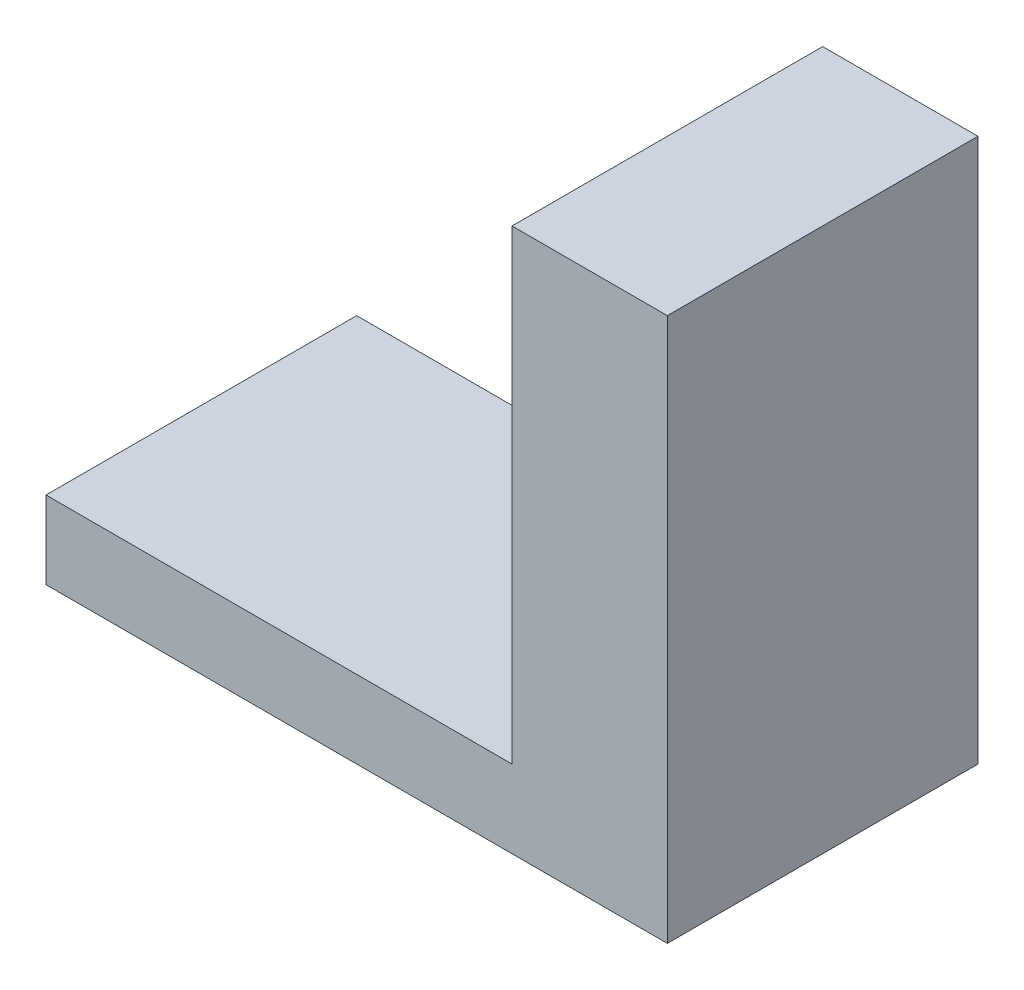
ISO-10303-21;
HEADER;
FILE_DESCRIPTION(('STEP AP214'),'2;1');
FILE_NAME('part.step','',(''),(''),'','','');
FILE_SCHEMA(('AUTOMOTIVE_DESIGN { 1 0 10303 214 1 1 1 1 }'));
ENDSEC;
DATA;
#1=APPLICATION_CONTEXT('core data for automotive mechanical design processes');
#2=APPLICATION_PROTOCOL_DEFINITION('international standard','automotive_design',2000,#1);
#3=PRODUCT_CONTEXT('',#1,'mechanical');
#4=PRODUCT('Part','Part','',(#3));
#5=PRODUCT_RELATED_PRODUCT_CATEGORY('part','',(#4));
#6=PRODUCT_DEFINITION_FORMATION('','',#4);
#7=PRODUCT_DEFINITION_CONTEXT('part definition',#1,'design');
#8=PRODUCT_DEFINITION('design','',#6,#7);
#9=PRODUCT_DEFINITION_SHAPE('','',#8);
#10=(LENGTH_UNIT() NAMED_UNIT(*) SI_UNIT(.MILLI.,.METRE.));
#11=(NAMED_UNIT(*) PLANE_ANGLE_UNIT() SI_UNIT($,.RADIAN.));
#12=(NAMED_UNIT(*) SI_UNIT($,.STERADIAN.) SOLID_ANGLE_UNIT());
#13=UNCERTAINTY_MEASURE_WITH_UNIT(LENGTH_MEASURE(1.E-05),#10,'distance_accuracy_value','');
#14=(GEOMETRIC_REPRESENTATION_CONTEXT(3) GLOBAL_UNCERTAINTY_ASSIGNED_CONTEXT((#13)) GLOBAL_UNIT_ASSIGNED_CONTEXT((#10,
#11,#12)) REPRESENTATION_CONTEXT('',''));
#15=CARTESIAN_POINT('',(0.,0.,0.));
#16=DIRECTION('',(0.,0.,1.));
#17=DIRECTION('',(1.,0.,0.));
#18=AXIS2_PLACEMENT_3D('',#15,#16,#17);
#19=CARTESIAN_POINT('',(-13.6877777777778,3.175,-6.17361111111111));
#20=DIRECTION('',(1.,0.,0.));
#21=DIRECTION('',(0.,0.,-1.));
#22=AXIS2_PLACEMENT_3D('',#19,#20,#21);
#23=PLANE('',#22);
#24=DIRECTION('',(0.,0.,1.));
#25=VECTOR('',#24,1.);
#26=CARTESIAN_POINT('',(-13.6877777777778,0.,-6.17361111111111));
#27=LINE('',#26,#25);
#28=CARTESIAN_POINT('',(-13.6877777777778,0.,-6.17361111111111));
#29=VERTEX_POINT('',#28);
#30=CARTESIAN_POINT('',(-13.6877777777778,0.,6.52638888888889));
#31=VERTEX_POINT('',#30);
#32=EDGE_CURVE('E89',#29,#31,#27,.T.);
#33=ORIENTED_EDGE('',*,*,#32,.T.);
#34=DIRECTION('',(0.,-1.,0.));
#35=VECTOR('',#34,1.);
#36=CARTESIAN_POINT('',(-13.6877777777778,3.175,6.52638888888889));
#37=LINE('',#36,#35);
#38=CARTESIAN_POINT('',(-13.6877777777778,3.175,6.52638888888889));
#39=VERTEX_POINT('',#38);
#40=EDGE_CURVE('E11',#39,#31,#37,.T.);
#41=ORIENTED_EDGE('',*,*,#40,.F.);
#42=DIRECTION('',(0.,0.,1.));
#43=VECTOR('',#42,1.);
#44=CARTESIAN_POINT('',(-13.6877777777778,3.175,-6.17361111111111));
#45=LINE('',#44,#43);
#46=CARTESIAN_POINT('',(-13.6877777777778,3.175,-6.17361111111111));
#47=VERTEX_POINT('',#46);
#48=EDGE_CURVE('E83',#47,#39,#45,.T.);
#49=ORIENTED_EDGE('',*,*,#48,.F.);
#50=DIRECTION('',(0.,-1.,0.));
#51=VECTOR('',#50,1.);
#52=CARTESIAN_POINT('',(-13.6877777777778,3.175,-6.17361111111111));
#53=LINE('',#52,#51);
#54=EDGE_CURVE('E75',#47,#29,#53,.T.);
#55=ORIENTED_EDGE('',*,*,#54,.T.);
#56=EDGE_LOOP('',(#33,#41,#49,#55));
#57=FACE_BOUND('',#56,.T.);
#58=ADVANCED_FACE('F33',(#57),#23,.F.);
#59=CARTESIAN_POINT('',(-13.6877777777778,3.175,6.52638888888889));
#60=DIRECTION('',(0.,0.,-1.));
#61=DIRECTION('',(-1.,0.,0.));
#62=AXIS2_PLACEMENT_3D('',#59,#60,#61);
#63=PLANE('',#62);
#64=DIRECTION('',(1.,0.,0.));
#65=VECTOR('',#64,1.);
#66=CARTESIAN_POINT('',(-13.6877777777778,0.,6.52638888888889));
#67=LINE('',#66,#65);
#68=CARTESIAN_POINT('',(11.7122222222222,0.,6.52638888888889));
#69=VERTEX_POINT('',#68);
#70=EDGE_CURVE('E92',#31,#69,#67,.T.);
#71=ORIENTED_EDGE('',*,*,#70,.T.);
#72=DIRECTION('',(0.,-1.,0.));
#73=VECTOR('',#72,1.);
#74=CARTESIAN_POINT('',(11.7122222222222,3.175,6.52638888888889));
#75=LINE('',#74,#73);
#76=CARTESIAN_POINT('',(11.7122222222222,22.225,6.52638888888889));
#77=VERTEX_POINT('',#76);
#78=EDGE_CURVE('E40',#77,#69,#75,.T.);
#79=ORIENTED_EDGE('',*,*,#78,.F.);
#80=DIRECTION('',(1.,0.,0.));
#81=VECTOR('',#80,1.);
#82=CARTESIAN_POINT('',(11.7122222222222,22.225,6.52638888888889));
#83=LINE('',#82,#81);
#84=CARTESIAN_POINT('',(5.36222222222222,22.225,6.52638888888889));
#85=VERTEX_POINT('',#84);
#86=EDGE_CURVE('E116',#85,#77,#83,.T.);
#87=ORIENTED_EDGE('',*,*,#86,.F.);
#88=DIRECTION('',(0.,-1.,0.));
#89=VECTOR('',#88,1.);
#90=CARTESIAN_POINT('',(5.36222222222222,22.225,6.52638888888889));
#91=LINE('',#90,#89);
#92=CARTESIAN_POINT('',(5.36222222222222,3.175,6.52638888888889));
#93=VERTEX_POINT('',#92);
#94=EDGE_CURVE('E97',#85,#93,#91,.T.);
#95=ORIENTED_EDGE('',*,*,#94,.T.);
#96=DIRECTION('',(1.,0.,0.));
#97=VECTOR('',#96,1.);
#98=CARTESIAN_POINT('',(-13.6877777777778,3.175,6.52638888888889));
#99=LINE('',#98,#97);
#100=EDGE_CURVE('E133',#39,#93,#99,.T.);
#101=ORIENTED_EDGE('',*,*,#100,.F.);
#102=ORIENTED_EDGE('',*,*,#40,.T.);
#103=EDGE_LOOP('',(#71,#79,#87,#95,#101,#102));
#104=FACE_BOUND('',#103,.T.);
#105=ADVANCED_FACE('F113',(#104),#63,.F.);
#106=CARTESIAN_POINT('',(11.7122222222222,3.175,-6.17361111111111));
#107=DIRECTION('',(-1.,0.,0.));
#108=DIRECTION('',(0.,0.,1.));
#109=AXIS2_PLACEMENT_3D('',#106,#107,#108);
#110=PLANE('',#109);
#111=DIRECTION('',(0.,0.,-1.));
#112=VECTOR('',#111,1.);
#113=CARTESIAN_POINT('',(11.7122222222222,0.,-6.17361111111111));
#114=LINE('',#113,#112);
#115=CARTESIAN_POINT('',(11.7122222222222,0.,-6.17361111111111));
#116=VERTEX_POINT('',#115);
#117=EDGE_CURVE('E84',#69,#116,#114,.T.);
#118=ORIENTED_EDGE('',*,*,#117,.T.);
#119=DIRECTION('',(0.,-1.,0.));
#120=VECTOR('',#119,1.);
#121=CARTESIAN_POINT('',(11.7122222222222,3.175,-6.17361111111111));
#122=LINE('',#121,#120);
#123=CARTESIAN_POINT('',(11.7122222222222,22.225,-6.17361111111111));
#124=VERTEX_POINT('',#123);
#125=EDGE_CURVE('E79',#124,#116,#122,.T.);
#126=ORIENTED_EDGE('',*,*,#125,.F.);
#127=DIRECTION('',(0.,0.,-1.));
#128=VECTOR('',#127,1.);
#129=CARTESIAN_POINT('',(11.7122222222222,22.225,-6.17361111111111));
#130=LINE('',#129,#128);
#131=EDGE_CURVE('E109',#77,#124,#130,.T.);
#132=ORIENTED_EDGE('',*,*,#131,.F.);
#133=ORIENTED_EDGE('',*,*,#78,.T.);
#134=EDGE_LOOP('',(#118,#126,#132,#133));
#135=FACE_BOUND('',#134,.T.);
#136=ADVANCED_FACE('F107',(#135),#110,.F.);
#137=CARTESIAN_POINT('',(-13.6877777777778,3.175,-6.17361111111111));
#138=DIRECTION('',(0.,0.,1.));
#139=DIRECTION('',(1.,0.,0.));
#140=AXIS2_PLACEMENT_3D('',#137,#138,#139);
#141=PLANE('',#140);
#142=DIRECTION('',(-1.,0.,0.));
#143=VECTOR('',#142,1.);
#144=CARTESIAN_POINT('',(-13.6877777777778,0.,-6.17361111111111));
#145=LINE('',#144,#143);
#146=EDGE_CURVE('E72',#116,#29,#145,.T.);
#147=ORIENTED_EDGE('',*,*,#146,.T.);
#148=ORIENTED_EDGE('',*,*,#54,.F.);
#149=DIRECTION('',(-1.,0.,0.));
#150=VECTOR('',#149,1.);
#151=CARTESIAN_POINT('',(-13.6877777777778,3.175,-6.17361111111111));
#152=LINE('',#151,#150);
#153=CARTESIAN_POINT('',(5.36222222222222,3.175,-6.17361111111111));
#154=VERTEX_POINT('',#153);
#155=EDGE_CURVE('E52',#154,#47,#152,.T.);
#156=ORIENTED_EDGE('',*,*,#155,.F.);
#157=DIRECTION('',(0.,-1.,0.));
#158=VECTOR('',#157,1.);
#159=CARTESIAN_POINT('',(5.36222222222222,22.225,-6.17361111111111));
#160=LINE('',#159,#158);
#161=CARTESIAN_POINT('',(5.36222222222222,22.225,-6.17361111111111));
#162=VERTEX_POINT('',#161);
#163=EDGE_CURVE('E93',#162,#154,#160,.T.);
#164=ORIENTED_EDGE('',*,*,#163,.F.);
#165=DIRECTION('',(-1.,0.,0.));
#166=VECTOR('',#165,1.);
#167=CARTESIAN_POINT('',(11.7122222222222,22.225,-6.17361111111111));
#168=LINE('',#167,#166);
#169=EDGE_CURVE('E128',#124,#162,#168,.T.);
#170=ORIENTED_EDGE('',*,*,#169,.F.);
#171=ORIENTED_EDGE('',*,*,#125,.T.);
#172=EDGE_LOOP('',(#147,#148,#156,#164,#170,#171));
#173=FACE_BOUND('',#172,.T.);
#174=ADVANCED_FACE('F74',(#173),#141,.F.);
#175=CARTESIAN_POINT('',(0.,3.175,0.));
#176=DIRECTION('',(0.,1.,0.));
#177=DIRECTION('',(0.,0.,1.));
#178=AXIS2_PLACEMENT_3D('',#175,#176,#177);
#179=PLANE('',#178);
#180=DIRECTION('',(0.,0.,1.));
#181=VECTOR('',#180,1.);
#182=CARTESIAN_POINT('',(5.36222222222222,3.175,-6.17361111111111));
#183=LINE('',#182,#181);
#184=EDGE_CURVE('E47',#154,#93,#183,.T.);
#185=ORIENTED_EDGE('',*,*,#184,.F.);
#186=ORIENTED_EDGE('',*,*,#155,.T.);
#187=ORIENTED_EDGE('',*,*,#48,.T.);
#188=ORIENTED_EDGE('',*,*,#100,.T.);
#189=EDGE_LOOP('',(#185,#186,#187,#188));
#190=FACE_BOUND('',#189,.T.);
#191=ADVANCED_FACE('F135',(#190),#179,.T.);
#192=CARTESIAN_POINT('',(0.,0.,0.));
#193=DIRECTION('',(0.,1.,0.));
#194=DIRECTION('',(0.,0.,1.));
#195=AXIS2_PLACEMENT_3D('',#192,#193,#194);
#196=PLANE('',#195);
#197=ORIENTED_EDGE('',*,*,#32,.F.);
#198=ORIENTED_EDGE('',*,*,#146,.F.);
#199=ORIENTED_EDGE('',*,*,#117,.F.);
#200=ORIENTED_EDGE('',*,*,#70,.F.);
#201=EDGE_LOOP('',(#197,#198,#199,#200));
#202=FACE_BOUND('',#201,.T.);
#203=ADVANCED_FACE('F91',(#202),#196,.F.);
#204=CARTESIAN_POINT('',(5.36222222222222,22.225,-6.17361111111111));
#205=DIRECTION('',(1.,0.,0.));
#206=DIRECTION('',(0.,0.,-1.));
#207=AXIS2_PLACEMENT_3D('',#204,#205,#206);
#208=PLANE('',#207);
#209=ORIENTED_EDGE('',*,*,#184,.T.);
#210=ORIENTED_EDGE('',*,*,#94,.F.);
#211=DIRECTION('',(0.,0.,1.));
#212=VECTOR('',#211,1.);
#213=CARTESIAN_POINT('',(5.36222222222222,22.225,-6.17361111111111));
#214=LINE('',#213,#212);
#215=EDGE_CURVE('E124',#162,#85,#214,.T.);
#216=ORIENTED_EDGE('',*,*,#215,.F.);
#217=ORIENTED_EDGE('',*,*,#163,.T.);
#218=EDGE_LOOP('',(#209,#210,#216,#217));
#219=FACE_BOUND('',#218,.T.);
#220=ADVANCED_FACE('F137',(#219),#208,.F.);
#221=CARTESIAN_POINT('',(0.,22.225,0.));
#222=DIRECTION('',(0.,-1.,0.));
#223=DIRECTION('',(0.,0.,-1.));
#224=AXIS2_PLACEMENT_3D('',#221,#222,#223);
#225=PLANE('',#224);
#226=ORIENTED_EDGE('',*,*,#131,.T.);
#227=ORIENTED_EDGE('',*,*,#169,.T.);
#228=ORIENTED_EDGE('',*,*,#215,.T.);
#229=ORIENTED_EDGE('',*,*,#86,.T.);
#230=EDGE_LOOP('',(#226,#227,#228,#229));
#231=FACE_BOUND('',#230,.T.);
#232=ADVANCED_FACE('F120',(#231),#225,.F.);
#233=CLOSED_SHELL('',(#58,#105,#136,#174,#191,#203,#220,#232));
#234=MANIFOLD_SOLID_BREP('B2',#233);
#235=ADVANCED_BREP_SHAPE_REPRESENTATION('',(#18,#234),#14);
#236=SHAPE_DEFINITION_REPRESENTATION(#9,#235);
ENDSEC;
END-ISO-10303-21;
